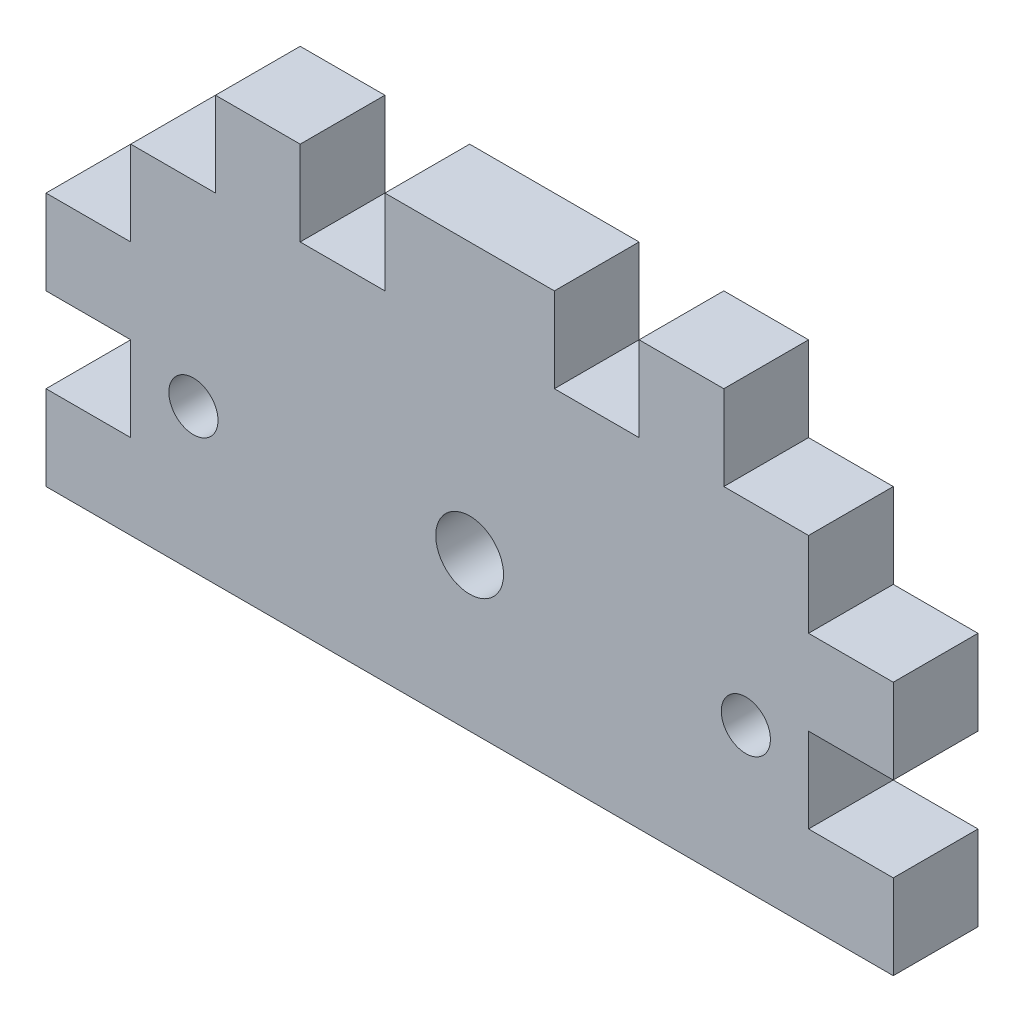
ISO-10303-21;
HEADER;
FILE_DESCRIPTION(('STEP AP214'),'2;1');
FILE_NAME('part.step','',(''),(''),'','','');
FILE_SCHEMA(('AUTOMOTIVE_DESIGN { 1 0 10303 214 1 1 1 1 }'));
ENDSEC;
DATA;
#1=APPLICATION_CONTEXT('core data for automotive mechanical design processes');
#2=APPLICATION_PROTOCOL_DEFINITION('international standard','automotive_design',2000,#1);
#3=PRODUCT_CONTEXT('',#1,'mechanical');
#4=PRODUCT('Part','Part','',(#3));
#5=PRODUCT_RELATED_PRODUCT_CATEGORY('part','',(#4));
#6=PRODUCT_DEFINITION_FORMATION('','',#4);
#7=PRODUCT_DEFINITION_CONTEXT('part definition',#1,'design');
#8=PRODUCT_DEFINITION('design','',#6,#7);
#9=PRODUCT_DEFINITION_SHAPE('','',#8);
#10=(LENGTH_UNIT() NAMED_UNIT(*) SI_UNIT(.MILLI.,.METRE.));
#11=(NAMED_UNIT(*) PLANE_ANGLE_UNIT() SI_UNIT($,.RADIAN.));
#12=(NAMED_UNIT(*) SI_UNIT($,.STERADIAN.) SOLID_ANGLE_UNIT());
#13=UNCERTAINTY_MEASURE_WITH_UNIT(LENGTH_MEASURE(1.E-05),#10,'distance_accuracy_value','');
#14=(GEOMETRIC_REPRESENTATION_CONTEXT(3) GLOBAL_UNCERTAINTY_ASSIGNED_CONTEXT((#13)) GLOBAL_UNIT_ASSIGNED_CONTEXT((#10,
#11,#12)) REPRESENTATION_CONTEXT('',''));
#15=CARTESIAN_POINT('',(0.,0.,0.));
#16=DIRECTION('',(0.,0.,1.));
#17=DIRECTION('',(1.,0.,0.));
#18=AXIS2_PLACEMENT_3D('',#15,#16,#17);
#19=CARTESIAN_POINT('',(0.,0.,5.));
#20=DIRECTION('',(0.,0.,1.));
#21=DIRECTION('',(1.,0.,0.));
#22=AXIS2_PLACEMENT_3D('',#19,#20,#21);
#23=PLANE('',#22);
#24=CARTESIAN_POINT('',(-66.021610088224,-28.9075757575758,5.));
#25=DIRECTION('',(0.,0.,1.));
#26=DIRECTION('',(1.,0.,0.));
#27=AXIS2_PLACEMENT_3D('',#24,#25,#26);
#28=CIRCLE('',#27,2.);
#29=CARTESIAN_POINT('',(-64.021610088224,-28.9075757575758,5.));
#30=VERTEX_POINT('',#29);
#31=EDGE_CURVE('E247',#30,#30,#28,.T.);
#32=ORIENTED_EDGE('',*,*,#31,.F.);
#33=EDGE_LOOP('',(#32));
#34=FACE_BOUND('',#33,.T.);
#35=CARTESIAN_POINT('',(-82.321610088224,-29.4575757575758,5.));
#36=DIRECTION('',(0.,0.,1.));
#37=DIRECTION('',(1.,0.,0.));
#38=AXIS2_PLACEMENT_3D('',#35,#36,#37);
#39=CIRCLE('',#38,1.45);
#40=CARTESIAN_POINT('',(-80.871610088224,-29.4575757575758,5.));
#41=VERTEX_POINT('',#40);
#42=EDGE_CURVE('E258',#41,#41,#39,.T.);
#43=ORIENTED_EDGE('',*,*,#42,.F.);
#44=EDGE_LOOP('',(#43));
#45=FACE_BOUND('',#44,.T.);
#46=CARTESIAN_POINT('',(-49.721610088224,-29.4575757575758,5.));
#47=DIRECTION('',(0.,0.,-1.));
#48=DIRECTION('',(-1.,0.,0.));
#49=AXIS2_PLACEMENT_3D('',#46,#47,#48);
#50=CIRCLE('',#49,1.45);
#51=CARTESIAN_POINT('',(-51.171610088224,-29.4575757575758,5.));
#52=VERTEX_POINT('',#51);
#53=EDGE_CURVE('E356',#52,#52,#50,.T.);
#54=ORIENTED_EDGE('',*,*,#53,.T.);
#55=EDGE_LOOP('',(#54));
#56=FACE_BOUND('',#55,.T.);
#57=DIRECTION('',(-1.,0.,0.));
#58=VECTOR('',#57,1.);
#59=CARTESIAN_POINT('',(-66.021610088224,-12.9075757575758,5.));
#60=LINE('',#59,#58);
#61=CARTESIAN_POINT('',(-61.021610088224,-12.9075757575758,5.));
#62=VERTEX_POINT('',#61);
#63=CARTESIAN_POINT('',(-71.0216100882241,-12.9075757575758,5.));
#64=VERTEX_POINT('',#63);
#65=EDGE_CURVE('E242',#62,#64,#60,.T.);
#66=ORIENTED_EDGE('',*,*,#65,.T.);
#67=DIRECTION('',(0.,1.,0.));
#68=VECTOR('',#67,1.);
#69=CARTESIAN_POINT('',(-71.0216100882241,-12.9075757575758,5.));
#70=LINE('',#69,#68);
#71=CARTESIAN_POINT('',(-71.0216100882241,-17.9075757575758,5.));
#72=VERTEX_POINT('',#71);
#73=EDGE_CURVE('E230',#72,#64,#70,.T.);
#74=ORIENTED_EDGE('',*,*,#73,.F.);
#75=DIRECTION('',(1.,0.,0.));
#76=VECTOR('',#75,1.);
#77=CARTESIAN_POINT('',(-71.0216100882241,-17.9075757575758,5.));
#78=LINE('',#77,#76);
#79=CARTESIAN_POINT('',(-76.0216100882241,-17.9075757575758,5.));
#80=VERTEX_POINT('',#79);
#81=EDGE_CURVE('E219',#80,#72,#78,.T.);
#82=ORIENTED_EDGE('',*,*,#81,.F.);
#83=DIRECTION('',(0.,-1.,0.));
#84=VECTOR('',#83,1.);
#85=CARTESIAN_POINT('',(-76.0216100882241,-12.9075757575758,5.));
#86=LINE('',#85,#84);
#87=CARTESIAN_POINT('',(-76.0216100882241,-12.9075757575758,5.));
#88=VERTEX_POINT('',#87);
#89=EDGE_CURVE('E229',#88,#80,#86,.T.);
#90=ORIENTED_EDGE('',*,*,#89,.F.);
#91=CARTESIAN_POINT('',(-81.0216100882241,-12.9075757575758,5.));
#92=VERTEX_POINT('',#91);
#93=EDGE_CURVE('E430',#88,#92,#60,.T.);
#94=ORIENTED_EDGE('',*,*,#93,.T.);
#95=DIRECTION('',(0.,1.,0.));
#96=VECTOR('',#95,1.);
#97=CARTESIAN_POINT('',(-81.0216100882241,-17.9075757575758,5.));
#98=LINE('',#97,#96);
#99=CARTESIAN_POINT('',(-81.0216100882241,-17.9075757575758,5.));
#100=VERTEX_POINT('',#99);
#101=EDGE_CURVE('E287',#100,#92,#98,.T.);
#102=ORIENTED_EDGE('',*,*,#101,.F.);
#103=DIRECTION('',(1.,0.,0.));
#104=VECTOR('',#103,1.);
#105=CARTESIAN_POINT('',(-86.0216100882241,-17.9075757575758,5.));
#106=LINE('',#105,#104);
#107=CARTESIAN_POINT('',(-86.0216100882241,-17.9075757575758,5.));
#108=VERTEX_POINT('',#107);
#109=EDGE_CURVE('E290',#108,#100,#106,.T.);
#110=ORIENTED_EDGE('',*,*,#109,.F.);
#111=DIRECTION('',(0.,1.,0.));
#112=VECTOR('',#111,1.);
#113=CARTESIAN_POINT('',(-86.0216100882241,-22.9075757575758,5.));
#114=LINE('',#113,#112);
#115=CARTESIAN_POINT('',(-86.0216100882241,-22.9075757575758,5.));
#116=VERTEX_POINT('',#115);
#117=EDGE_CURVE('E293',#116,#108,#114,.T.);
#118=ORIENTED_EDGE('',*,*,#117,.F.);
#119=DIRECTION('',(1.,0.,0.));
#120=VECTOR('',#119,1.);
#121=CARTESIAN_POINT('',(-91.021610088224,-22.9075757575758,5.));
#122=LINE('',#121,#120);
#123=CARTESIAN_POINT('',(-91.021610088224,-22.9075757575758,5.));
#124=VERTEX_POINT('',#123);
#125=EDGE_CURVE('E295',#124,#116,#122,.T.);
#126=ORIENTED_EDGE('',*,*,#125,.F.);
#127=DIRECTION('',(0.,1.,0.));
#128=VECTOR('',#127,1.);
#129=CARTESIAN_POINT('',(-91.021610088224,-12.9075757575758,5.));
#130=LINE('',#129,#128);
#131=CARTESIAN_POINT('',(-91.021610088224,-27.9075757575758,5.));
#132=VERTEX_POINT('',#131);
#133=EDGE_CURVE('E324',#132,#124,#130,.T.);
#134=ORIENTED_EDGE('',*,*,#133,.F.);
#135=DIRECTION('',(-1.,0.,0.));
#136=VECTOR('',#135,1.);
#137=CARTESIAN_POINT('',(-91.0216100882241,-27.9075757575758,5.));
#138=LINE('',#137,#136);
#139=CARTESIAN_POINT('',(-86.0216100882241,-27.9075757575758,5.));
#140=VERTEX_POINT('',#139);
#141=EDGE_CURVE('E56',#140,#132,#138,.T.);
#142=ORIENTED_EDGE('',*,*,#141,.F.);
#143=DIRECTION('',(0.,1.,0.));
#144=VECTOR('',#143,1.);
#145=CARTESIAN_POINT('',(-86.021610088224,-32.9075757575758,5.));
#146=LINE('',#145,#144);
#147=CARTESIAN_POINT('',(-86.021610088224,-32.9075757575758,5.));
#148=VERTEX_POINT('',#147);
#149=EDGE_CURVE('E265',#148,#140,#146,.T.);
#150=ORIENTED_EDGE('',*,*,#149,.F.);
#151=DIRECTION('',(1.,0.,0.));
#152=VECTOR('',#151,1.);
#153=CARTESIAN_POINT('',(-91.0216100882241,-32.9075757575758,5.));
#154=LINE('',#153,#152);
#155=CARTESIAN_POINT('',(-91.0216100882241,-32.9075757575758,5.));
#156=VERTEX_POINT('',#155);
#157=EDGE_CURVE('E268',#156,#148,#154,.T.);
#158=ORIENTED_EDGE('',*,*,#157,.F.);
#159=CARTESIAN_POINT('',(-91.021610088224,-37.9075757575758,5.));
#160=VERTEX_POINT('',#159);
#161=EDGE_CURVE('E320',#160,#156,#130,.T.);
#162=ORIENTED_EDGE('',*,*,#161,.F.);
#163=DIRECTION('',(1.,0.,0.));
#164=VECTOR('',#163,1.);
#165=CARTESIAN_POINT('',(-66.021610088224,-37.9075757575758,5.));
#166=LINE('',#165,#164);
#167=CARTESIAN_POINT('',(-41.021610088224,-37.9075757575758,5.));
#168=VERTEX_POINT('',#167);
#169=EDGE_CURVE('E423',#160,#168,#166,.T.);
#170=ORIENTED_EDGE('',*,*,#169,.T.);
#171=DIRECTION('',(0.,1.,0.));
#172=VECTOR('',#171,1.);
#173=CARTESIAN_POINT('',(-41.021610088224,-12.9075757575758,5.));
#174=LINE('',#173,#172);
#175=CARTESIAN_POINT('',(-41.021610088224,-32.9075757575758,5.));
#176=VERTEX_POINT('',#175);
#177=EDGE_CURVE('E427',#168,#176,#174,.T.);
#178=ORIENTED_EDGE('',*,*,#177,.T.);
#179=DIRECTION('',(-1.,0.,0.));
#180=VECTOR('',#179,1.);
#181=CARTESIAN_POINT('',(-41.021610088224,-32.9075757575758,5.));
#182=LINE('',#181,#180);
#183=CARTESIAN_POINT('',(-46.021610088224,-32.9075757575758,5.));
#184=VERTEX_POINT('',#183);
#185=EDGE_CURVE('E362',#176,#184,#182,.T.);
#186=ORIENTED_EDGE('',*,*,#185,.T.);
#187=DIRECTION('',(0.,1.,0.));
#188=VECTOR('',#187,1.);
#189=CARTESIAN_POINT('',(-46.021610088224,-32.9075757575758,5.));
#190=LINE('',#189,#188);
#191=CARTESIAN_POINT('',(-46.021610088224,-27.9075757575758,5.));
#192=VERTEX_POINT('',#191);
#193=EDGE_CURVE('E365',#184,#192,#190,.T.);
#194=ORIENTED_EDGE('',*,*,#193,.T.);
#195=DIRECTION('',(1.,0.,0.));
#196=VECTOR('',#195,1.);
#197=CARTESIAN_POINT('',(-41.021610088224,-27.9075757575758,5.));
#198=LINE('',#197,#196);
#199=CARTESIAN_POINT('',(-41.021610088224,-27.9075757575758,5.));
#200=VERTEX_POINT('',#199);
#201=EDGE_CURVE('E369',#192,#200,#198,.T.);
#202=ORIENTED_EDGE('',*,*,#201,.T.);
#203=CARTESIAN_POINT('',(-41.021610088224,-22.9075757575758,5.));
#204=VERTEX_POINT('',#203);
#205=EDGE_CURVE('E425',#200,#204,#174,.T.);
#206=ORIENTED_EDGE('',*,*,#205,.T.);
#207=DIRECTION('',(-1.,0.,0.));
#208=VECTOR('',#207,1.);
#209=CARTESIAN_POINT('',(-41.021610088224,-22.9075757575758,5.));
#210=LINE('',#209,#208);
#211=CARTESIAN_POINT('',(-46.021610088224,-22.9075757575758,5.));
#212=VERTEX_POINT('',#211);
#213=EDGE_CURVE('E388',#204,#212,#210,.T.);
#214=ORIENTED_EDGE('',*,*,#213,.T.);
#215=DIRECTION('',(0.,1.,0.));
#216=VECTOR('',#215,1.);
#217=CARTESIAN_POINT('',(-46.021610088224,-22.9075757575758,5.));
#218=LINE('',#217,#216);
#219=CARTESIAN_POINT('',(-46.021610088224,-17.9075757575758,5.));
#220=VERTEX_POINT('',#219);
#221=EDGE_CURVE('E391',#212,#220,#218,.T.);
#222=ORIENTED_EDGE('',*,*,#221,.T.);
#223=DIRECTION('',(-1.,0.,0.));
#224=VECTOR('',#223,1.);
#225=CARTESIAN_POINT('',(-46.021610088224,-17.9075757575758,5.));
#226=LINE('',#225,#224);
#227=CARTESIAN_POINT('',(-51.021610088224,-17.9075757575758,5.));
#228=VERTEX_POINT('',#227);
#229=EDGE_CURVE('E395',#220,#228,#226,.T.);
#230=ORIENTED_EDGE('',*,*,#229,.T.);
#231=DIRECTION('',(0.,1.,0.));
#232=VECTOR('',#231,1.);
#233=CARTESIAN_POINT('',(-51.021610088224,-17.9075757575758,5.));
#234=LINE('',#233,#232);
#235=CARTESIAN_POINT('',(-51.021610088224,-12.9075757575758,5.));
#236=VERTEX_POINT('',#235);
#237=EDGE_CURVE('E398',#228,#236,#234,.T.);
#238=ORIENTED_EDGE('',*,*,#237,.T.);
#239=CARTESIAN_POINT('',(-56.021610088224,-12.9075757575758,5.));
#240=VERTEX_POINT('',#239);
#241=EDGE_CURVE('E41',#236,#240,#60,.T.);
#242=ORIENTED_EDGE('',*,*,#241,.T.);
#243=DIRECTION('',(0.,-1.,0.));
#244=VECTOR('',#243,1.);
#245=CARTESIAN_POINT('',(-56.021610088224,-12.9075757575758,5.));
#246=LINE('',#245,#244);
#247=CARTESIAN_POINT('',(-56.021610088224,-17.9075757575758,5.));
#248=VERTEX_POINT('',#247);
#249=EDGE_CURVE('E333',#240,#248,#246,.T.);
#250=ORIENTED_EDGE('',*,*,#249,.T.);
#251=DIRECTION('',(-1.,0.,0.));
#252=VECTOR('',#251,1.);
#253=CARTESIAN_POINT('',(-61.021610088224,-17.9075757575758,5.));
#254=LINE('',#253,#252);
#255=CARTESIAN_POINT('',(-61.021610088224,-17.9075757575758,5.));
#256=VERTEX_POINT('',#255);
#257=EDGE_CURVE('E337',#248,#256,#254,.T.);
#258=ORIENTED_EDGE('',*,*,#257,.T.);
#259=DIRECTION('',(0.,1.,0.));
#260=VECTOR('',#259,1.);
#261=CARTESIAN_POINT('',(-61.021610088224,-12.9075757575758,5.));
#262=LINE('',#261,#260);
#263=EDGE_CURVE('E331',#256,#62,#262,.T.);
#264=ORIENTED_EDGE('',*,*,#263,.T.);
#265=EDGE_LOOP('',(#66,#74,#82,#90,#94,#102,#110,#118,#126,#134,#142,#150,#158,#162,#170,#178,
#186,#194,#202,#206,#214,#222,#230,#238,#242,#250,#258,#264));
#266=FACE_BOUND('',#265,.T.);
#267=ADVANCED_FACE('F32',(#34,#45,#56,#266),#23,.T.);
#268=CARTESIAN_POINT('',(0.,0.,0.));
#269=DIRECTION('',(0.,0.,1.));
#270=DIRECTION('',(1.,0.,0.));
#271=AXIS2_PLACEMENT_3D('',#268,#269,#270);
#272=PLANE('',#271);
#273=CARTESIAN_POINT('',(-66.021610088224,-28.9075757575758,0.));
#274=DIRECTION('',(0.,0.,1.));
#275=DIRECTION('',(1.,0.,0.));
#276=AXIS2_PLACEMENT_3D('',#273,#274,#275);
#277=CIRCLE('',#276,2.);
#278=CARTESIAN_POINT('',(-64.021610088224,-28.9075757575758,0.));
#279=VERTEX_POINT('',#278);
#280=EDGE_CURVE('E36',#279,#279,#277,.T.);
#281=ORIENTED_EDGE('',*,*,#280,.T.);
#282=EDGE_LOOP('',(#281));
#283=FACE_BOUND('',#282,.T.);
#284=CARTESIAN_POINT('',(-82.321610088224,-29.4575757575758,0.));
#285=DIRECTION('',(0.,0.,1.));
#286=DIRECTION('',(1.,0.,0.));
#287=AXIS2_PLACEMENT_3D('',#284,#285,#286);
#288=CIRCLE('',#287,1.45);
#289=CARTESIAN_POINT('',(-80.871610088224,-29.4575757575758,0.));
#290=VERTEX_POINT('',#289);
#291=EDGE_CURVE('E254',#290,#290,#288,.T.);
#292=ORIENTED_EDGE('',*,*,#291,.T.);
#293=EDGE_LOOP('',(#292));
#294=FACE_BOUND('',#293,.T.);
#295=CARTESIAN_POINT('',(-49.721610088224,-29.4575757575758,0.));
#296=DIRECTION('',(0.,0.,-1.));
#297=DIRECTION('',(-1.,0.,0.));
#298=AXIS2_PLACEMENT_3D('',#295,#296,#297);
#299=CIRCLE('',#298,1.45);
#300=CARTESIAN_POINT('',(-51.171610088224,-29.4575757575758,0.));
#301=VERTEX_POINT('',#300);
#302=EDGE_CURVE('E349',#301,#301,#299,.T.);
#303=ORIENTED_EDGE('',*,*,#302,.F.);
#304=EDGE_LOOP('',(#303));
#305=FACE_BOUND('',#304,.T.);
#306=DIRECTION('',(0.,1.,0.));
#307=VECTOR('',#306,1.);
#308=CARTESIAN_POINT('',(-71.0216100882241,-12.9075757575758,0.));
#309=LINE('',#308,#307);
#310=CARTESIAN_POINT('',(-71.0216100882241,-17.9075757575758,0.));
#311=VERTEX_POINT('',#310);
#312=CARTESIAN_POINT('',(-71.0216100882241,-12.9075757575758,0.));
#313=VERTEX_POINT('',#312);
#314=EDGE_CURVE('E236',#311,#313,#309,.T.);
#315=ORIENTED_EDGE('',*,*,#314,.T.);
#316=DIRECTION('',(-1.,0.,0.));
#317=VECTOR('',#316,1.);
#318=CARTESIAN_POINT('',(-66.021610088224,-12.9075757575758,0.));
#319=LINE('',#318,#317);
#320=CARTESIAN_POINT('',(-61.021610088224,-12.9075757575758,0.));
#321=VERTEX_POINT('',#320);
#322=EDGE_CURVE('E440',#321,#313,#319,.T.);
#323=ORIENTED_EDGE('',*,*,#322,.F.);
#324=DIRECTION('',(0.,1.,0.));
#325=VECTOR('',#324,1.);
#326=CARTESIAN_POINT('',(-61.021610088224,-12.9075757575758,0.));
#327=LINE('',#326,#325);
#328=CARTESIAN_POINT('',(-61.021610088224,-17.9075757575758,0.));
#329=VERTEX_POINT('',#328);
#330=EDGE_CURVE('E330',#329,#321,#327,.T.);
#331=ORIENTED_EDGE('',*,*,#330,.F.);
#332=DIRECTION('',(-1.,0.,0.));
#333=VECTOR('',#332,1.);
#334=CARTESIAN_POINT('',(-61.021610088224,-17.9075757575758,0.));
#335=LINE('',#334,#333);
#336=CARTESIAN_POINT('',(-56.021610088224,-17.9075757575758,0.));
#337=VERTEX_POINT('',#336);
#338=EDGE_CURVE('E334',#337,#329,#335,.T.);
#339=ORIENTED_EDGE('',*,*,#338,.F.);
#340=DIRECTION('',(0.,-1.,0.));
#341=VECTOR('',#340,1.);
#342=CARTESIAN_POINT('',(-56.021610088224,-12.9075757575758,0.));
#343=LINE('',#342,#341);
#344=CARTESIAN_POINT('',(-56.021610088224,-12.9075757575758,0.));
#345=VERTEX_POINT('',#344);
#346=EDGE_CURVE('E342',#345,#337,#343,.T.);
#347=ORIENTED_EDGE('',*,*,#346,.F.);
#348=CARTESIAN_POINT('',(-51.021610088224,-12.9075757575758,0.));
#349=VERTEX_POINT('',#348);
#350=EDGE_CURVE('E426',#349,#345,#319,.T.);
#351=ORIENTED_EDGE('',*,*,#350,.F.);
#352=DIRECTION('',(0.,1.,0.));
#353=VECTOR('',#352,1.);
#354=CARTESIAN_POINT('',(-51.021610088224,-17.9075757575758,0.));
#355=LINE('',#354,#353);
#356=CARTESIAN_POINT('',(-51.021610088224,-17.9075757575758,0.));
#357=VERTEX_POINT('',#356);
#358=EDGE_CURVE('E392',#357,#349,#355,.T.);
#359=ORIENTED_EDGE('',*,*,#358,.F.);
#360=DIRECTION('',(-1.,0.,0.));
#361=VECTOR('',#360,1.);
#362=CARTESIAN_POINT('',(-46.021610088224,-17.9075757575758,0.));
#363=LINE('',#362,#361);
#364=CARTESIAN_POINT('',(-46.021610088224,-17.9075757575758,0.));
#365=VERTEX_POINT('',#364);
#366=EDGE_CURVE('E407',#365,#357,#363,.T.);
#367=ORIENTED_EDGE('',*,*,#366,.F.);
#368=DIRECTION('',(0.,1.,0.));
#369=VECTOR('',#368,1.);
#370=CARTESIAN_POINT('',(-46.021610088224,-22.9075757575758,0.));
#371=LINE('',#370,#369);
#372=CARTESIAN_POINT('',(-46.021610088224,-22.9075757575758,0.));
#373=VERTEX_POINT('',#372);
#374=EDGE_CURVE('E404',#373,#365,#371,.T.);
#375=ORIENTED_EDGE('',*,*,#374,.F.);
#376=DIRECTION('',(-1.,0.,0.));
#377=VECTOR('',#376,1.);
#378=CARTESIAN_POINT('',(-41.021610088224,-22.9075757575758,0.));
#379=LINE('',#378,#377);
#380=CARTESIAN_POINT('',(-41.021610088224,-22.9075757575758,0.));
#381=VERTEX_POINT('',#380);
#382=EDGE_CURVE('E382',#381,#373,#379,.T.);
#383=ORIENTED_EDGE('',*,*,#382,.F.);
#384=DIRECTION('',(0.,1.,0.));
#385=VECTOR('',#384,1.);
#386=CARTESIAN_POINT('',(-41.021610088224,-12.9075757575758,0.));
#387=LINE('',#386,#385);
#388=CARTESIAN_POINT('',(-41.021610088224,-27.9075757575758,0.));
#389=VERTEX_POINT('',#388);
#390=EDGE_CURVE('E434',#389,#381,#387,.T.);
#391=ORIENTED_EDGE('',*,*,#390,.F.);
#392=DIRECTION('',(1.,0.,0.));
#393=VECTOR('',#392,1.);
#394=CARTESIAN_POINT('',(-41.021610088224,-27.9075757575758,0.));
#395=LINE('',#394,#393);
#396=CARTESIAN_POINT('',(-46.021610088224,-27.9075757575758,0.));
#397=VERTEX_POINT('',#396);
#398=EDGE_CURVE('E366',#397,#389,#395,.T.);
#399=ORIENTED_EDGE('',*,*,#398,.F.);
#400=DIRECTION('',(0.,1.,0.));
#401=VECTOR('',#400,1.);
#402=CARTESIAN_POINT('',(-46.021610088224,-32.9075757575758,0.));
#403=LINE('',#402,#401);
#404=CARTESIAN_POINT('',(-46.021610088224,-32.9075757575758,0.));
#405=VERTEX_POINT('',#404);
#406=EDGE_CURVE('E375',#405,#397,#403,.T.);
#407=ORIENTED_EDGE('',*,*,#406,.F.);
#408=DIRECTION('',(-1.,0.,0.));
#409=VECTOR('',#408,1.);
#410=CARTESIAN_POINT('',(-41.021610088224,-32.9075757575758,0.));
#411=LINE('',#410,#409);
#412=CARTESIAN_POINT('',(-41.021610088224,-32.9075757575758,0.));
#413=VERTEX_POINT('',#412);
#414=EDGE_CURVE('E359',#413,#405,#411,.T.);
#415=ORIENTED_EDGE('',*,*,#414,.F.);
#416=CARTESIAN_POINT('',(-41.021610088224,-37.9075757575758,0.));
#417=VERTEX_POINT('',#416);
#418=EDGE_CURVE('E435',#417,#413,#387,.T.);
#419=ORIENTED_EDGE('',*,*,#418,.F.);
#420=DIRECTION('',(1.,0.,0.));
#421=VECTOR('',#420,1.);
#422=CARTESIAN_POINT('',(-66.021610088224,-37.9075757575758,0.));
#423=LINE('',#422,#421);
#424=CARTESIAN_POINT('',(-91.021610088224,-37.9075757575758,0.));
#425=VERTEX_POINT('',#424);
#426=EDGE_CURVE('E414',#425,#417,#423,.T.);
#427=ORIENTED_EDGE('',*,*,#426,.F.);
#428=DIRECTION('',(0.,1.,0.));
#429=VECTOR('',#428,1.);
#430=CARTESIAN_POINT('',(-91.021610088224,-12.9075757575758,0.));
#431=LINE('',#430,#429);
#432=CARTESIAN_POINT('',(-91.0216100882241,-32.9075757575758,0.));
#433=VERTEX_POINT('',#432);
#434=EDGE_CURVE('E325',#425,#433,#431,.T.);
#435=ORIENTED_EDGE('',*,*,#434,.T.);
#436=DIRECTION('',(1.,0.,0.));
#437=VECTOR('',#436,1.);
#438=CARTESIAN_POINT('',(-91.0216100882241,-32.9075757575758,0.));
#439=LINE('',#438,#437);
#440=CARTESIAN_POINT('',(-86.021610088224,-32.9075757575758,0.));
#441=VERTEX_POINT('',#440);
#442=EDGE_CURVE('E266',#433,#441,#439,.T.);
#443=ORIENTED_EDGE('',*,*,#442,.T.);
#444=DIRECTION('',(0.,1.,0.));
#445=VECTOR('',#444,1.);
#446=CARTESIAN_POINT('',(-86.021610088224,-32.9075757575758,0.));
#447=LINE('',#446,#445);
#448=CARTESIAN_POINT('',(-86.0216100882241,-27.9075757575758,0.));
#449=VERTEX_POINT('',#448);
#450=EDGE_CURVE('E273',#441,#449,#447,.T.);
#451=ORIENTED_EDGE('',*,*,#450,.T.);
#452=DIRECTION('',(-1.,0.,0.));
#453=VECTOR('',#452,1.);
#454=CARTESIAN_POINT('',(-91.0216100882241,-27.9075757575758,0.));
#455=LINE('',#454,#453);
#456=CARTESIAN_POINT('',(-91.0216100882241,-27.9075757575758,0.));
#457=VERTEX_POINT('',#456);
#458=EDGE_CURVE('E261',#449,#457,#455,.T.);
#459=ORIENTED_EDGE('',*,*,#458,.T.);
#460=CARTESIAN_POINT('',(-91.021610088224,-22.9075757575758,0.));
#461=VERTEX_POINT('',#460);
#462=EDGE_CURVE('E311',#457,#461,#431,.T.);
#463=ORIENTED_EDGE('',*,*,#462,.T.);
#464=DIRECTION('',(1.,0.,0.));
#465=VECTOR('',#464,1.);
#466=CARTESIAN_POINT('',(-91.021610088224,-22.9075757575758,0.));
#467=LINE('',#466,#465);
#468=CARTESIAN_POINT('',(-86.0216100882241,-22.9075757575758,0.));
#469=VERTEX_POINT('',#468);
#470=EDGE_CURVE('E291',#461,#469,#467,.T.);
#471=ORIENTED_EDGE('',*,*,#470,.T.);
#472=DIRECTION('',(0.,1.,0.));
#473=VECTOR('',#472,1.);
#474=CARTESIAN_POINT('',(-86.0216100882241,-22.9075757575758,0.));
#475=LINE('',#474,#473);
#476=CARTESIAN_POINT('',(-86.0216100882241,-17.9075757575758,0.));
#477=VERTEX_POINT('',#476);
#478=EDGE_CURVE('E303',#469,#477,#475,.T.);
#479=ORIENTED_EDGE('',*,*,#478,.T.);
#480=DIRECTION('',(1.,0.,0.));
#481=VECTOR('',#480,1.);
#482=CARTESIAN_POINT('',(-86.0216100882241,-17.9075757575758,0.));
#483=LINE('',#482,#481);
#484=CARTESIAN_POINT('',(-81.0216100882241,-17.9075757575758,0.));
#485=VERTEX_POINT('',#484);
#486=EDGE_CURVE('E300',#477,#485,#483,.T.);
#487=ORIENTED_EDGE('',*,*,#486,.T.);
#488=DIRECTION('',(0.,1.,0.));
#489=VECTOR('',#488,1.);
#490=CARTESIAN_POINT('',(-81.0216100882241,-17.9075757575758,0.));
#491=LINE('',#490,#489);
#492=CARTESIAN_POINT('',(-81.0216100882241,-12.9075757575758,0.));
#493=VERTEX_POINT('',#492);
#494=EDGE_CURVE('E281',#485,#493,#491,.T.);
#495=ORIENTED_EDGE('',*,*,#494,.T.);
#496=CARTESIAN_POINT('',(-76.0216100882241,-12.9075757575758,0.));
#497=VERTEX_POINT('',#496);
#498=EDGE_CURVE('E438',#497,#493,#319,.T.);
#499=ORIENTED_EDGE('',*,*,#498,.F.);
#500=DIRECTION('',(0.,-1.,0.));
#501=VECTOR('',#500,1.);
#502=CARTESIAN_POINT('',(-76.0216100882241,-12.9075757575758,0.));
#503=LINE('',#502,#501);
#504=CARTESIAN_POINT('',(-76.0216100882241,-17.9075757575758,0.));
#505=VERTEX_POINT('',#504);
#506=EDGE_CURVE('E48',#497,#505,#503,.T.);
#507=ORIENTED_EDGE('',*,*,#506,.T.);
#508=DIRECTION('',(1.,0.,0.));
#509=VECTOR('',#508,1.);
#510=CARTESIAN_POINT('',(-71.0216100882241,-17.9075757575758,0.));
#511=LINE('',#510,#509);
#512=EDGE_CURVE('E244',#505,#311,#511,.T.);
#513=ORIENTED_EDGE('',*,*,#512,.T.);
#514=EDGE_LOOP('',(#315,#323,#331,#339,#347,#351,#359,#367,#375,#383,#391,#399,#407,#415,#419,
#427,#435,#443,#451,#459,#463,#471,#479,#487,#495,#499,#507,#513));
#515=FACE_BOUND('',#514,.T.);
#516=ADVANCED_FACE('F456',(#283,#294,#305,#515),#272,.F.);
#517=CARTESIAN_POINT('',(-66.021610088224,-12.9075757575758,5.));
#518=DIRECTION('',(0.,-1.,0.));
#519=DIRECTION('',(0.,0.,-1.));
#520=AXIS2_PLACEMENT_3D('',#517,#518,#519);
#521=PLANE('',#520);
#522=DIRECTION('',(0.,0.,-1.));
#523=VECTOR('',#522,1.);
#524=CARTESIAN_POINT('',(-71.0216100882241,-12.9075757575758,5.));
#525=LINE('',#524,#523);
#526=EDGE_CURVE('E252',#64,#313,#525,.T.);
#527=ORIENTED_EDGE('',*,*,#526,.F.);
#528=ORIENTED_EDGE('',*,*,#65,.F.);
#529=DIRECTION('',(0.,0.,-1.));
#530=VECTOR('',#529,1.);
#531=CARTESIAN_POINT('',(-61.021610088224,-12.9075757575758,5.));
#532=LINE('',#531,#530);
#533=EDGE_CURVE('E340',#62,#321,#532,.T.);
#534=ORIENTED_EDGE('',*,*,#533,.T.);
#535=ORIENTED_EDGE('',*,*,#322,.T.);
#536=EDGE_LOOP('',(#527,#528,#534,#535));
#537=FACE_BOUND('',#536,.T.);
#538=ADVANCED_FACE('F468',(#537),#521,.F.);
#539=DIRECTION('',(0.,0.,-1.));
#540=VECTOR('',#539,1.);
#541=CARTESIAN_POINT('',(-76.0216100882241,-12.9075757575758,5.));
#542=LINE('',#541,#540);
#543=EDGE_CURVE('E255',#88,#497,#542,.T.);
#544=ORIENTED_EDGE('',*,*,#543,.T.);
#545=ORIENTED_EDGE('',*,*,#498,.T.);
#546=DIRECTION('',(0.,0.,-1.));
#547=VECTOR('',#546,1.);
#548=CARTESIAN_POINT('',(-81.0216100882241,-12.9075757575758,5.));
#549=LINE('',#548,#547);
#550=EDGE_CURVE('E297',#92,#493,#549,.T.);
#551=ORIENTED_EDGE('',*,*,#550,.F.);
#552=ORIENTED_EDGE('',*,*,#93,.F.);
#553=EDGE_LOOP('',(#544,#545,#551,#552));
#554=FACE_BOUND('',#553,.T.);
#555=ADVANCED_FACE('F448',(#554),#521,.F.);
#556=CARTESIAN_POINT('',(-91.021610088224,-12.9075757575758,5.));
#557=DIRECTION('',(-1.,0.,0.));
#558=DIRECTION('',(0.,-1.,0.));
#559=AXIS2_PLACEMENT_3D('',#556,#557,#558);
#560=PLANE('',#559);
#561=ORIENTED_EDGE('',*,*,#161,.T.);
#562=DIRECTION('',(0.,0.,-1.));
#563=VECTOR('',#562,1.);
#564=CARTESIAN_POINT('',(-91.0216100882241,-32.9075757575758,5.));
#565=LINE('',#564,#563);
#566=EDGE_CURVE('E278',#156,#433,#565,.T.);
#567=ORIENTED_EDGE('',*,*,#566,.T.);
#568=ORIENTED_EDGE('',*,*,#434,.F.);
#569=DIRECTION('',(0.,0.,-1.));
#570=VECTOR('',#569,1.);
#571=CARTESIAN_POINT('',(-91.021610088224,-37.9075757575758,5.));
#572=LINE('',#571,#570);
#573=EDGE_CURVE('E323',#160,#425,#572,.T.);
#574=ORIENTED_EDGE('',*,*,#573,.F.);
#575=EDGE_LOOP('',(#561,#567,#568,#574));
#576=FACE_BOUND('',#575,.T.);
#577=ADVANCED_FACE('F522',(#576),#560,.T.);
#578=ORIENTED_EDGE('',*,*,#462,.F.);
#579=DIRECTION('',(0.,0.,-1.));
#580=VECTOR('',#579,1.);
#581=CARTESIAN_POINT('',(-91.0216100882241,-27.9075757575758,5.));
#582=LINE('',#581,#580);
#583=EDGE_CURVE('E270',#132,#457,#582,.T.);
#584=ORIENTED_EDGE('',*,*,#583,.F.);
#585=ORIENTED_EDGE('',*,*,#133,.T.);
#586=DIRECTION('',(0.,0.,-1.));
#587=VECTOR('',#586,1.);
#588=CARTESIAN_POINT('',(-91.021610088224,-22.9075757575758,5.));
#589=LINE('',#588,#587);
#590=EDGE_CURVE('E308',#124,#461,#589,.T.);
#591=ORIENTED_EDGE('',*,*,#590,.T.);
#592=EDGE_LOOP('',(#578,#584,#585,#591));
#593=FACE_BOUND('',#592,.T.);
#594=ADVANCED_FACE('F538',(#593),#560,.T.);
#595=CARTESIAN_POINT('',(-41.021610088224,-12.9075757575758,5.));
#596=DIRECTION('',(-1.,0.,0.));
#597=DIRECTION('',(0.,-1.,0.));
#598=AXIS2_PLACEMENT_3D('',#595,#596,#597);
#599=PLANE('',#598);
#600=ORIENTED_EDGE('',*,*,#205,.F.);
#601=DIRECTION('',(0.,0.,-1.));
#602=VECTOR('',#601,1.);
#603=CARTESIAN_POINT('',(-41.021610088224,-27.9075757575758,5.));
#604=LINE('',#603,#602);
#605=EDGE_CURVE('E379',#200,#389,#604,.T.);
#606=ORIENTED_EDGE('',*,*,#605,.T.);
#607=ORIENTED_EDGE('',*,*,#390,.T.);
#608=DIRECTION('',(0.,0.,-1.));
#609=VECTOR('',#608,1.);
#610=CARTESIAN_POINT('',(-41.021610088224,-22.9075757575758,5.));
#611=LINE('',#610,#609);
#612=EDGE_CURVE('E401',#204,#381,#611,.T.);
#613=ORIENTED_EDGE('',*,*,#612,.F.);
#614=EDGE_LOOP('',(#600,#606,#607,#613));
#615=FACE_BOUND('',#614,.T.);
#616=ADVANCED_FACE('F503',(#615),#599,.F.);
#617=CARTESIAN_POINT('',(-66.021610088224,-37.9075757575758,5.));
#618=DIRECTION('',(0.,1.,0.));
#619=DIRECTION('',(0.,0.,1.));
#620=AXIS2_PLACEMENT_3D('',#617,#618,#619);
#621=PLANE('',#620);
#622=ORIENTED_EDGE('',*,*,#426,.T.);
#623=DIRECTION('',(0.,0.,-1.));
#624=VECTOR('',#623,1.);
#625=CARTESIAN_POINT('',(-41.021610088224,-37.9075757575758,5.));
#626=LINE('',#625,#624);
#627=EDGE_CURVE('E11',#168,#417,#626,.T.);
#628=ORIENTED_EDGE('',*,*,#627,.F.);
#629=ORIENTED_EDGE('',*,*,#169,.F.);
#630=ORIENTED_EDGE('',*,*,#573,.T.);
#631=EDGE_LOOP('',(#622,#628,#629,#630));
#632=FACE_BOUND('',#631,.T.);
#633=ADVANCED_FACE('F34',(#632),#621,.F.);
#634=ORIENTED_EDGE('',*,*,#418,.T.);
#635=DIRECTION('',(0.,0.,-1.));
#636=VECTOR('',#635,1.);
#637=CARTESIAN_POINT('',(-41.021610088224,-32.9075757575758,5.));
#638=LINE('',#637,#636);
#639=EDGE_CURVE('E372',#176,#413,#638,.T.);
#640=ORIENTED_EDGE('',*,*,#639,.F.);
#641=ORIENTED_EDGE('',*,*,#177,.F.);
#642=ORIENTED_EDGE('',*,*,#627,.T.);
#643=EDGE_LOOP('',(#634,#640,#641,#642));
#644=FACE_BOUND('',#643,.T.);
#645=ADVANCED_FACE('F515',(#644),#599,.F.);
#646=ORIENTED_EDGE('',*,*,#350,.T.);
#647=DIRECTION('',(0.,0.,-1.));
#648=VECTOR('',#647,1.);
#649=CARTESIAN_POINT('',(-56.021610088224,-12.9075757575758,5.));
#650=LINE('',#649,#648);
#651=EDGE_CURVE('E352',#240,#345,#650,.T.);
#652=ORIENTED_EDGE('',*,*,#651,.F.);
#653=ORIENTED_EDGE('',*,*,#241,.F.);
#654=DIRECTION('',(0.,0.,-1.));
#655=VECTOR('',#654,1.);
#656=CARTESIAN_POINT('',(-51.021610088224,-12.9075757575758,5.));
#657=LINE('',#656,#655);
#658=EDGE_CURVE('E411',#236,#349,#657,.T.);
#659=ORIENTED_EDGE('',*,*,#658,.T.);
#660=EDGE_LOOP('',(#646,#652,#653,#659));
#661=FACE_BOUND('',#660,.T.);
#662=ADVANCED_FACE('F481',(#661),#521,.F.);
#663=CARTESIAN_POINT('',(-51.021610088224,-17.9075757575758,5.));
#664=DIRECTION('',(-1.,0.,0.));
#665=DIRECTION('',(0.,0.,1.));
#666=AXIS2_PLACEMENT_3D('',#663,#664,#665);
#667=PLANE('',#666);
#668=ORIENTED_EDGE('',*,*,#358,.T.);
#669=ORIENTED_EDGE('',*,*,#658,.F.);
#670=ORIENTED_EDGE('',*,*,#237,.F.);
#671=DIRECTION('',(0.,0.,-1.));
#672=VECTOR('',#671,1.);
#673=CARTESIAN_POINT('',(-51.021610088224,-17.9075757575758,5.));
#674=LINE('',#673,#672);
#675=EDGE_CURVE('E415',#228,#357,#674,.T.);
#676=ORIENTED_EDGE('',*,*,#675,.T.);
#677=EDGE_LOOP('',(#668,#669,#670,#676));
#678=FACE_BOUND('',#677,.T.);
#679=ADVANCED_FACE('F485',(#678),#667,.F.);
#680=CARTESIAN_POINT('',(-46.021610088224,-17.9075757575758,5.));
#681=DIRECTION('',(0.,-1.,0.));
#682=DIRECTION('',(0.,0.,-1.));
#683=AXIS2_PLACEMENT_3D('',#680,#681,#682);
#684=PLANE('',#683);
#685=ORIENTED_EDGE('',*,*,#366,.T.);
#686=ORIENTED_EDGE('',*,*,#675,.F.);
#687=ORIENTED_EDGE('',*,*,#229,.F.);
#688=DIRECTION('',(0.,0.,-1.));
#689=VECTOR('',#688,1.);
#690=CARTESIAN_POINT('',(-46.021610088224,-17.9075757575758,5.));
#691=LINE('',#690,#689);
#692=EDGE_CURVE('E417',#220,#365,#691,.T.);
#693=ORIENTED_EDGE('',*,*,#692,.T.);
#694=EDGE_LOOP('',(#685,#686,#687,#693));
#695=FACE_BOUND('',#694,.T.);
#696=ADVANCED_FACE('F490',(#695),#684,.F.);
#697=CARTESIAN_POINT('',(-46.021610088224,-22.9075757575758,5.));
#698=DIRECTION('',(-1.,0.,0.));
#699=DIRECTION('',(0.,0.,1.));
#700=AXIS2_PLACEMENT_3D('',#697,#698,#699);
#701=PLANE('',#700);
#702=ORIENTED_EDGE('',*,*,#374,.T.);
#703=ORIENTED_EDGE('',*,*,#692,.F.);
#704=ORIENTED_EDGE('',*,*,#221,.F.);
#705=DIRECTION('',(0.,0.,-1.));
#706=VECTOR('',#705,1.);
#707=CARTESIAN_POINT('',(-46.021610088224,-22.9075757575758,5.));
#708=LINE('',#707,#706);
#709=EDGE_CURVE('E419',#212,#373,#708,.T.);
#710=ORIENTED_EDGE('',*,*,#709,.T.);
#711=EDGE_LOOP('',(#702,#703,#704,#710));
#712=FACE_BOUND('',#711,.T.);
#713=ADVANCED_FACE('F493',(#712),#701,.F.);
#714=CARTESIAN_POINT('',(-41.021610088224,-22.9075757575758,5.));
#715=DIRECTION('',(0.,-1.,0.));
#716=DIRECTION('',(0.,0.,-1.));
#717=AXIS2_PLACEMENT_3D('',#714,#715,#716);
#718=PLANE('',#717);
#719=ORIENTED_EDGE('',*,*,#382,.T.);
#720=ORIENTED_EDGE('',*,*,#709,.F.);
#721=ORIENTED_EDGE('',*,*,#213,.F.);
#722=ORIENTED_EDGE('',*,*,#612,.T.);
#723=EDGE_LOOP('',(#719,#720,#721,#722));
#724=FACE_BOUND('',#723,.T.);
#725=ADVANCED_FACE('F496',(#724),#718,.F.);
#726=CARTESIAN_POINT('',(-41.021610088224,-27.9075757575758,5.));
#727=DIRECTION('',(0.,1.,0.));
#728=DIRECTION('',(0.,0.,1.));
#729=AXIS2_PLACEMENT_3D('',#726,#727,#728);
#730=PLANE('',#729);
#731=ORIENTED_EDGE('',*,*,#398,.T.);
#732=ORIENTED_EDGE('',*,*,#605,.F.);
#733=ORIENTED_EDGE('',*,*,#201,.F.);
#734=DIRECTION('',(0.,0.,-1.));
#735=VECTOR('',#734,1.);
#736=CARTESIAN_POINT('',(-46.021610088224,-27.9075757575758,5.));
#737=LINE('',#736,#735);
#738=EDGE_CURVE('E383',#192,#397,#737,.T.);
#739=ORIENTED_EDGE('',*,*,#738,.T.);
#740=EDGE_LOOP('',(#731,#732,#733,#739));
#741=FACE_BOUND('',#740,.T.);
#742=ADVANCED_FACE('F506',(#741),#730,.F.);
#743=CARTESIAN_POINT('',(-46.021610088224,-32.9075757575758,5.));
#744=DIRECTION('',(-1.,0.,0.));
#745=DIRECTION('',(0.,-1.,0.));
#746=AXIS2_PLACEMENT_3D('',#743,#744,#745);
#747=PLANE('',#746);
#748=ORIENTED_EDGE('',*,*,#406,.T.);
#749=ORIENTED_EDGE('',*,*,#738,.F.);
#750=ORIENTED_EDGE('',*,*,#193,.F.);
#751=DIRECTION('',(0.,0.,-1.));
#752=VECTOR('',#751,1.);
#753=CARTESIAN_POINT('',(-46.021610088224,-32.9075757575758,5.));
#754=LINE('',#753,#752);
#755=EDGE_CURVE('E385',#184,#405,#754,.T.);
#756=ORIENTED_EDGE('',*,*,#755,.T.);
#757=EDGE_LOOP('',(#748,#749,#750,#756));
#758=FACE_BOUND('',#757,.T.);
#759=ADVANCED_FACE('F509',(#758),#747,.F.);
#760=CARTESIAN_POINT('',(-41.021610088224,-32.9075757575758,5.));
#761=DIRECTION('',(0.,-1.,0.));
#762=DIRECTION('',(0.,0.,-1.));
#763=AXIS2_PLACEMENT_3D('',#760,#761,#762);
#764=PLANE('',#763);
#765=ORIENTED_EDGE('',*,*,#414,.T.);
#766=ORIENTED_EDGE('',*,*,#755,.F.);
#767=ORIENTED_EDGE('',*,*,#185,.F.);
#768=ORIENTED_EDGE('',*,*,#639,.T.);
#769=EDGE_LOOP('',(#765,#766,#767,#768));
#770=FACE_BOUND('',#769,.T.);
#771=ADVANCED_FACE('F591',(#770),#764,.F.);
#772=CARTESIAN_POINT('',(-49.721610088224,-29.4575757575758,5.));
#773=DIRECTION('',(0.,0.,-1.));
#774=DIRECTION('',(-1.,0.,0.));
#775=AXIS2_PLACEMENT_3D('',#772,#773,#774);
#776=CYLINDRICAL_SURFACE('',#775,1.45);
#777=ORIENTED_EDGE('',*,*,#53,.F.);
#778=EDGE_LOOP('',(#777));
#779=FACE_BOUND('',#778,.T.);
#780=ORIENTED_EDGE('',*,*,#302,.T.);
#781=EDGE_LOOP('',(#780));
#782=FACE_BOUND('',#781,.T.);
#783=ADVANCED_FACE('F588',(#779,#782),#776,.F.);
#784=CARTESIAN_POINT('',(-61.021610088224,-12.9075757575758,5.));
#785=DIRECTION('',(-1.,0.,0.));
#786=DIRECTION('',(0.,0.,1.));
#787=AXIS2_PLACEMENT_3D('',#784,#785,#786);
#788=PLANE('',#787);
#789=ORIENTED_EDGE('',*,*,#330,.T.);
#790=ORIENTED_EDGE('',*,*,#533,.F.);
#791=ORIENTED_EDGE('',*,*,#263,.F.);
#792=DIRECTION('',(0.,0.,-1.));
#793=VECTOR('',#792,1.);
#794=CARTESIAN_POINT('',(-61.021610088224,-17.9075757575758,5.));
#795=LINE('',#794,#793);
#796=EDGE_CURVE('E347',#256,#329,#795,.T.);
#797=ORIENTED_EDGE('',*,*,#796,.T.);
#798=EDGE_LOOP('',(#789,#790,#791,#797));
#799=FACE_BOUND('',#798,.T.);
#800=ADVANCED_FACE('F471',(#799),#788,.F.);
#801=CARTESIAN_POINT('',(-61.021610088224,-17.9075757575758,5.));
#802=DIRECTION('',(0.,-1.,0.));
#803=DIRECTION('',(1.,0.,0.));
#804=AXIS2_PLACEMENT_3D('',#801,#802,#803);
#805=PLANE('',#804);
#806=ORIENTED_EDGE('',*,*,#338,.T.);
#807=ORIENTED_EDGE('',*,*,#796,.F.);
#808=ORIENTED_EDGE('',*,*,#257,.F.);
#809=DIRECTION('',(0.,0.,-1.));
#810=VECTOR('',#809,1.);
#811=CARTESIAN_POINT('',(-56.021610088224,-17.9075757575758,5.));
#812=LINE('',#811,#810);
#813=EDGE_CURVE('E350',#248,#337,#812,.T.);
#814=ORIENTED_EDGE('',*,*,#813,.T.);
#815=EDGE_LOOP('',(#806,#807,#808,#814));
#816=FACE_BOUND('',#815,.T.);
#817=ADVANCED_FACE('F474',(#816),#805,.F.);
#818=CARTESIAN_POINT('',(-56.021610088224,-12.9075757575758,5.));
#819=DIRECTION('',(1.,0.,0.));
#820=DIRECTION('',(0.,0.,-1.));
#821=AXIS2_PLACEMENT_3D('',#818,#819,#820);
#822=PLANE('',#821);
#823=ORIENTED_EDGE('',*,*,#346,.T.);
#824=ORIENTED_EDGE('',*,*,#813,.F.);
#825=ORIENTED_EDGE('',*,*,#249,.F.);
#826=ORIENTED_EDGE('',*,*,#651,.T.);
#827=EDGE_LOOP('',(#823,#824,#825,#826));
#828=FACE_BOUND('',#827,.T.);
#829=ADVANCED_FACE('F479',(#828),#822,.F.);
#830=CARTESIAN_POINT('',(-91.021610088224,-22.9075757575758,5.));
#831=DIRECTION('',(0.,1.,0.));
#832=DIRECTION('',(0.,0.,1.));
#833=AXIS2_PLACEMENT_3D('',#830,#831,#832);
#834=PLANE('',#833);
#835=ORIENTED_EDGE('',*,*,#470,.F.);
#836=ORIENTED_EDGE('',*,*,#590,.F.);
#837=ORIENTED_EDGE('',*,*,#125,.T.);
#838=DIRECTION('',(0.,0.,-1.));
#839=VECTOR('',#838,1.);
#840=CARTESIAN_POINT('',(-86.0216100882241,-22.9075757575758,5.));
#841=LINE('',#840,#839);
#842=EDGE_CURVE('E312',#116,#469,#841,.T.);
#843=ORIENTED_EDGE('',*,*,#842,.T.);
#844=EDGE_LOOP('',(#835,#836,#837,#843));
#845=FACE_BOUND('',#844,.T.);
#846=ADVANCED_FACE('F542',(#845),#834,.T.);
#847=CARTESIAN_POINT('',(-86.0216100882241,-22.9075757575758,5.));
#848=DIRECTION('',(-1.,0.,0.));
#849=DIRECTION('',(0.,0.,1.));
#850=AXIS2_PLACEMENT_3D('',#847,#848,#849);
#851=PLANE('',#850);
#852=ORIENTED_EDGE('',*,*,#478,.F.);
#853=ORIENTED_EDGE('',*,*,#842,.F.);
#854=ORIENTED_EDGE('',*,*,#117,.T.);
#855=DIRECTION('',(0.,0.,-1.));
#856=VECTOR('',#855,1.);
#857=CARTESIAN_POINT('',(-86.0216100882241,-17.9075757575758,5.));
#858=LINE('',#857,#856);
#859=EDGE_CURVE('E314',#108,#477,#858,.T.);
#860=ORIENTED_EDGE('',*,*,#859,.T.);
#861=EDGE_LOOP('',(#852,#853,#854,#860));
#862=FACE_BOUND('',#861,.T.);
#863=ADVANCED_FACE('F545',(#862),#851,.T.);
#864=CARTESIAN_POINT('',(-86.0216100882241,-17.9075757575758,5.));
#865=DIRECTION('',(0.,1.,0.));
#866=DIRECTION('',(0.,0.,1.));
#867=AXIS2_PLACEMENT_3D('',#864,#865,#866);
#868=PLANE('',#867);
#869=ORIENTED_EDGE('',*,*,#486,.F.);
#870=ORIENTED_EDGE('',*,*,#859,.F.);
#871=ORIENTED_EDGE('',*,*,#109,.T.);
#872=DIRECTION('',(0.,0.,-1.));
#873=VECTOR('',#872,1.);
#874=CARTESIAN_POINT('',(-81.0216100882241,-17.9075757575758,5.));
#875=LINE('',#874,#873);
#876=EDGE_CURVE('E316',#100,#485,#875,.T.);
#877=ORIENTED_EDGE('',*,*,#876,.T.);
#878=EDGE_LOOP('',(#869,#870,#871,#877));
#879=FACE_BOUND('',#878,.T.);
#880=ADVANCED_FACE('F461',(#879),#868,.T.);
#881=CARTESIAN_POINT('',(-81.0216100882241,-17.9075757575758,5.));
#882=DIRECTION('',(-1.,0.,0.));
#883=DIRECTION('',(0.,0.,1.));
#884=AXIS2_PLACEMENT_3D('',#881,#882,#883);
#885=PLANE('',#884);
#886=ORIENTED_EDGE('',*,*,#494,.F.);
#887=ORIENTED_EDGE('',*,*,#876,.F.);
#888=ORIENTED_EDGE('',*,*,#101,.T.);
#889=ORIENTED_EDGE('',*,*,#550,.T.);
#890=EDGE_LOOP('',(#886,#887,#888,#889));
#891=FACE_BOUND('',#890,.T.);
#892=ADVANCED_FACE('F453',(#891),#885,.T.);
#893=CARTESIAN_POINT('',(-91.0216100882241,-32.9075757575758,5.));
#894=DIRECTION('',(0.,1.,0.));
#895=DIRECTION('',(0.,0.,1.));
#896=AXIS2_PLACEMENT_3D('',#893,#894,#895);
#897=PLANE('',#896);
#898=ORIENTED_EDGE('',*,*,#442,.F.);
#899=ORIENTED_EDGE('',*,*,#566,.F.);
#900=ORIENTED_EDGE('',*,*,#157,.T.);
#901=DIRECTION('',(0.,0.,-1.));
#902=VECTOR('',#901,1.);
#903=CARTESIAN_POINT('',(-86.021610088224,-32.9075757575758,5.));
#904=LINE('',#903,#902);
#905=EDGE_CURVE('E282',#148,#441,#904,.T.);
#906=ORIENTED_EDGE('',*,*,#905,.T.);
#907=EDGE_LOOP('',(#898,#899,#900,#906));
#908=FACE_BOUND('',#907,.T.);
#909=ADVANCED_FACE('F526',(#908),#897,.T.);
#910=CARTESIAN_POINT('',(-86.021610088224,-32.9075757575758,5.));
#911=DIRECTION('',(-1.,0.,0.));
#912=DIRECTION('',(0.,-1.,0.));
#913=AXIS2_PLACEMENT_3D('',#910,#911,#912);
#914=PLANE('',#913);
#915=ORIENTED_EDGE('',*,*,#450,.F.);
#916=ORIENTED_EDGE('',*,*,#905,.F.);
#917=ORIENTED_EDGE('',*,*,#149,.T.);
#918=DIRECTION('',(0.,0.,-1.));
#919=VECTOR('',#918,1.);
#920=CARTESIAN_POINT('',(-86.0216100882241,-27.9075757575758,5.));
#921=LINE('',#920,#919);
#922=EDGE_CURVE('E284',#140,#449,#921,.T.);
#923=ORIENTED_EDGE('',*,*,#922,.T.);
#924=EDGE_LOOP('',(#915,#916,#917,#923));
#925=FACE_BOUND('',#924,.T.);
#926=ADVANCED_FACE('F532',(#925),#914,.T.);
#927=CARTESIAN_POINT('',(-91.0216100882241,-27.9075757575758,5.));
#928=DIRECTION('',(0.,-1.,0.));
#929=DIRECTION('',(0.,0.,-1.));
#930=AXIS2_PLACEMENT_3D('',#927,#928,#929);
#931=PLANE('',#930);
#932=ORIENTED_EDGE('',*,*,#458,.F.);
#933=ORIENTED_EDGE('',*,*,#922,.F.);
#934=ORIENTED_EDGE('',*,*,#141,.T.);
#935=ORIENTED_EDGE('',*,*,#583,.T.);
#936=EDGE_LOOP('',(#932,#933,#934,#935));
#937=FACE_BOUND('',#936,.T.);
#938=ADVANCED_FACE('F534',(#937),#931,.T.);
#939=CARTESIAN_POINT('',(-82.321610088224,-29.4575757575758,5.));
#940=DIRECTION('',(0.,0.,-1.));
#941=DIRECTION('',(-1.,0.,0.));
#942=AXIS2_PLACEMENT_3D('',#939,#940,#941);
#943=CYLINDRICAL_SURFACE('',#942,1.45);
#944=ORIENTED_EDGE('',*,*,#42,.T.);
#945=EDGE_LOOP('',(#944));
#946=FACE_BOUND('',#945,.T.);
#947=ORIENTED_EDGE('',*,*,#291,.F.);
#948=EDGE_LOOP('',(#947));
#949=FACE_BOUND('',#948,.T.);
#950=ADVANCED_FACE('F687',(#946,#949),#943,.F.);
#951=CARTESIAN_POINT('',(-71.0216100882241,-12.9075757575758,5.));
#952=DIRECTION('',(-1.,0.,0.));
#953=DIRECTION('',(0.,0.,1.));
#954=AXIS2_PLACEMENT_3D('',#951,#952,#953);
#955=PLANE('',#954);
#956=ORIENTED_EDGE('',*,*,#314,.F.);
#957=DIRECTION('',(0.,0.,-1.));
#958=VECTOR('',#957,1.);
#959=CARTESIAN_POINT('',(-71.0216100882241,-17.9075757575758,5.));
#960=LINE('',#959,#958);
#961=EDGE_CURVE('E223',#72,#311,#960,.T.);
#962=ORIENTED_EDGE('',*,*,#961,.F.);
#963=ORIENTED_EDGE('',*,*,#73,.T.);
#964=ORIENTED_EDGE('',*,*,#526,.T.);
#965=EDGE_LOOP('',(#956,#962,#963,#964));
#966=FACE_BOUND('',#965,.T.);
#967=ADVANCED_FACE('F233',(#966),#955,.T.);
#968=CARTESIAN_POINT('',(-76.0216100882241,-12.9075757575758,5.));
#969=DIRECTION('',(1.,0.,0.));
#970=DIRECTION('',(0.,0.,-1.));
#971=AXIS2_PLACEMENT_3D('',#968,#969,#970);
#972=PLANE('',#971);
#973=ORIENTED_EDGE('',*,*,#506,.F.);
#974=ORIENTED_EDGE('',*,*,#543,.F.);
#975=ORIENTED_EDGE('',*,*,#89,.T.);
#976=DIRECTION('',(0.,0.,-1.));
#977=VECTOR('',#976,1.);
#978=CARTESIAN_POINT('',(-76.0216100882241,-17.9075757575758,5.));
#979=LINE('',#978,#977);
#980=EDGE_CURVE('E225',#80,#505,#979,.T.);
#981=ORIENTED_EDGE('',*,*,#980,.T.);
#982=EDGE_LOOP('',(#973,#974,#975,#981));
#983=FACE_BOUND('',#982,.T.);
#984=ADVANCED_FACE('F464',(#983),#972,.T.);
#985=CARTESIAN_POINT('',(-71.0216100882241,-17.9075757575758,5.));
#986=DIRECTION('',(0.,1.,0.));
#987=DIRECTION('',(-1.,0.,0.));
#988=AXIS2_PLACEMENT_3D('',#985,#986,#987);
#989=PLANE('',#988);
#990=ORIENTED_EDGE('',*,*,#512,.F.);
#991=ORIENTED_EDGE('',*,*,#980,.F.);
#992=ORIENTED_EDGE('',*,*,#81,.T.);
#993=ORIENTED_EDGE('',*,*,#961,.T.);
#994=EDGE_LOOP('',(#990,#991,#992,#993));
#995=FACE_BOUND('',#994,.T.);
#996=ADVANCED_FACE('F222',(#995),#989,.T.);
#997=CARTESIAN_POINT('',(-66.021610088224,-28.9075757575758,-5.));
#998=DIRECTION('',(0.,0.,1.));
#999=DIRECTION('',(1.,0.,0.));
#1000=AXIS2_PLACEMENT_3D('',#997,#998,#999);
#1001=CYLINDRICAL_SURFACE('',#1000,2.);
#1002=ORIENTED_EDGE('',*,*,#31,.T.);
#1003=EDGE_LOOP('',(#1002));
#1004=FACE_BOUND('',#1003,.T.);
#1005=ORIENTED_EDGE('',*,*,#280,.F.);
#1006=EDGE_LOOP('',(#1005));
#1007=FACE_BOUND('',#1006,.T.);
#1008=ADVANCED_FACE('F720',(#1004,#1007),#1001,.F.);
#1009=CLOSED_SHELL('',(#267,#516,#538,#555,#577,#594,#616,#633,#645,#662,#679,#696,#713,#725,
#742,#759,#771,#783,#800,#817,#829,#846,#863,#880,#892,#909,#926,#938,#950,#967,#984,#996,#1008));
#1010=MANIFOLD_SOLID_BREP('B2',#1009);
#1011=ADVANCED_BREP_SHAPE_REPRESENTATION('',(#18,#1010),#14);
#1012=SHAPE_DEFINITION_REPRESENTATION(#9,#1011);
ENDSEC;
END-ISO-10303-21;
